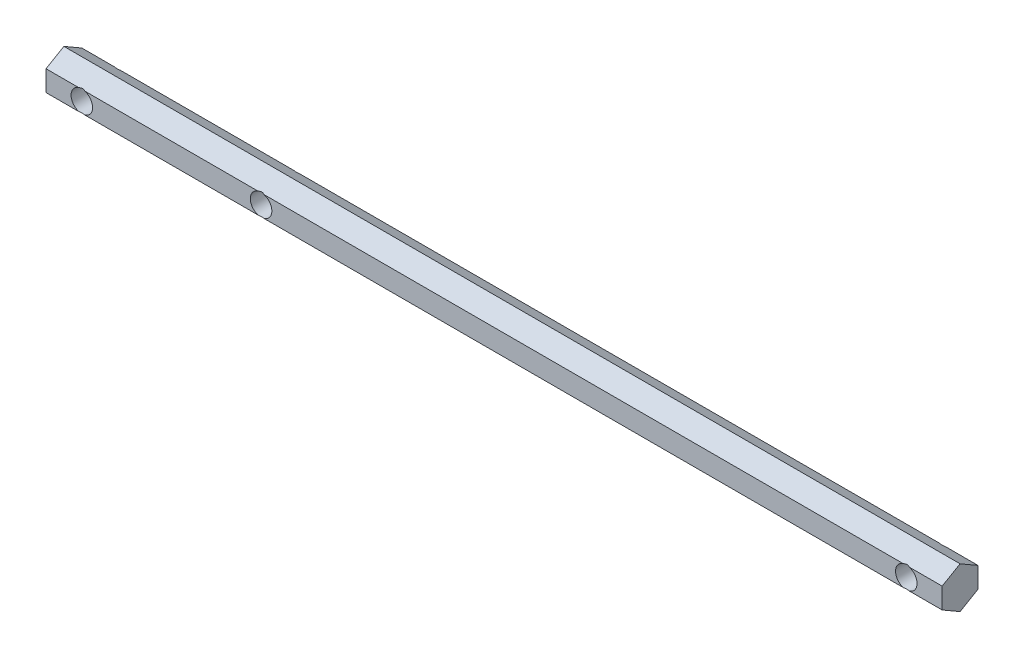
ISO-10303-21;
HEADER;
FILE_DESCRIPTION(('STEP AP214'),'2;1');
FILE_NAME('part.step','',(''),(''),'','','');
FILE_SCHEMA(('AUTOMOTIVE_DESIGN { 1 0 10303 214 1 1 1 1 }'));
ENDSEC;
DATA;
#1=APPLICATION_CONTEXT('core data for automotive mechanical design processes');
#2=APPLICATION_PROTOCOL_DEFINITION('international standard','automotive_design',2000,#1);
#3=PRODUCT_CONTEXT('',#1,'mechanical');
#4=PRODUCT('Part','Part','',(#3));
#5=PRODUCT_RELATED_PRODUCT_CATEGORY('part','',(#4));
#6=PRODUCT_DEFINITION_FORMATION('','',#4);
#7=PRODUCT_DEFINITION_CONTEXT('part definition',#1,'design');
#8=PRODUCT_DEFINITION('design','',#6,#7);
#9=PRODUCT_DEFINITION_SHAPE('','',#8);
#10=(LENGTH_UNIT() NAMED_UNIT(*) SI_UNIT(.MILLI.,.METRE.));
#11=(NAMED_UNIT(*) PLANE_ANGLE_UNIT() SI_UNIT($,.RADIAN.));
#12=(NAMED_UNIT(*) SI_UNIT($,.STERADIAN.) SOLID_ANGLE_UNIT());
#13=UNCERTAINTY_MEASURE_WITH_UNIT(LENGTH_MEASURE(1.E-05),#10,'distance_accuracy_value','');
#14=(GEOMETRIC_REPRESENTATION_CONTEXT(3) GLOBAL_UNCERTAINTY_ASSIGNED_CONTEXT((#13)) GLOBAL_UNIT_ASSIGNED_CONTEXT((#10,
#11,#12)) REPRESENTATION_CONTEXT('',''));
#15=CARTESIAN_POINT('',(0.,0.,0.));
#16=DIRECTION('',(0.,0.,1.));
#17=DIRECTION('',(1.,0.,0.));
#18=AXIS2_PLACEMENT_3D('',#15,#16,#17);
#19=CARTESIAN_POINT('',(125.,2.88675134594811,5.));
#20=DIRECTION('',(0.,0.,-1.));
#21=DIRECTION('',(0.,1.,0.));
#22=AXIS2_PLACEMENT_3D('',#19,#20,#21);
#23=PLANE('',#22);
#24=DIRECTION('',(-1.,0.,0.));
#25=VECTOR('',#24,1.);
#26=CARTESIAN_POINT('',(125.,2.88675134594811,5.));
#27=LINE('',#26,#25);
#28=CARTESIAN_POINT('',(125.,2.88675134594811,5.));
#29=VERTEX_POINT('',#28);
#30=CARTESIAN_POINT('',(115.816496580928,2.88675134594811,5.));
#31=VERTEX_POINT('',#30);
#32=EDGE_CURVE('E220',#29,#31,#27,.T.);
#33=ORIENTED_EDGE('',*,*,#32,.T.);
#34=CARTESIAN_POINT('',(115.,0.,5.));
#35=DIRECTION('',(0.,0.,1.));
#36=DIRECTION('',(1.,0.,0.));
#37=AXIS2_PLACEMENT_3D('',#34,#35,#36);
#38=CIRCLE('',#37,3.00000000000001);
#39=CARTESIAN_POINT('',(115.816496580928,-2.88675134594814,5.));
#40=VERTEX_POINT('',#39);
#41=EDGE_CURVE('E350',#40,#31,#38,.T.);
#42=ORIENTED_EDGE('',*,*,#41,.F.);
#43=DIRECTION('',(-1.,0.,0.));
#44=VECTOR('',#43,1.);
#45=CARTESIAN_POINT('',(125.,-2.88675134594815,4.99999999999998));
#46=LINE('',#45,#44);
#47=CARTESIAN_POINT('',(125.,-2.88675134594815,4.99999999999998));
#48=VERTEX_POINT('',#47);
#49=EDGE_CURVE('E214',#48,#40,#46,.T.);
#50=ORIENTED_EDGE('',*,*,#49,.F.);
#51=DIRECTION('',(0.,-1.,0.));
#52=VECTOR('',#51,1.);
#53=CARTESIAN_POINT('',(125.,2.88675134594811,5.));
#54=LINE('',#53,#52);
#55=EDGE_CURVE('E279',#29,#48,#54,.T.);
#56=ORIENTED_EDGE('',*,*,#55,.F.);
#57=EDGE_LOOP('',(#33,#42,#50,#56));
#58=FACE_BOUND('',#57,.T.);
#59=ADVANCED_FACE('F39',(#58),#23,.F.);
#60=CARTESIAN_POINT('',(-65.8164965809277,2.88675134594811,5.));
#61=VERTEX_POINT('',#60);
#62=CARTESIAN_POINT('',(-114.183503419072,2.88675134594811,5.));
#63=VERTEX_POINT('',#62);
#64=EDGE_CURVE('E317',#61,#63,#27,.T.);
#65=ORIENTED_EDGE('',*,*,#64,.T.);
#66=CARTESIAN_POINT('',(-115.,0.,5.));
#67=DIRECTION('',(0.,0.,1.));
#68=DIRECTION('',(1.,0.,0.));
#69=AXIS2_PLACEMENT_3D('',#66,#67,#68);
#70=CIRCLE('',#69,3.00000000000001);
#71=CARTESIAN_POINT('',(-114.183503419072,-2.88675134594814,5.));
#72=VERTEX_POINT('',#71);
#73=EDGE_CURVE('E371',#72,#63,#70,.T.);
#74=ORIENTED_EDGE('',*,*,#73,.F.);
#75=CARTESIAN_POINT('',(-65.8164965809278,-2.88675134594815,4.99999999999998));
#76=VERTEX_POINT('',#75);
#77=EDGE_CURVE('E360',#76,#72,#46,.T.);
#78=ORIENTED_EDGE('',*,*,#77,.F.);
#79=CARTESIAN_POINT('',(-65.,0.,5.));
#80=DIRECTION('',(0.,0.,1.));
#81=DIRECTION('',(1.,0.,0.));
#82=AXIS2_PLACEMENT_3D('',#79,#80,#81);
#83=CIRCLE('',#82,3.00000000000001);
#84=EDGE_CURVE('E63',#61,#76,#83,.T.);
#85=ORIENTED_EDGE('',*,*,#84,.F.);
#86=EDGE_LOOP('',(#65,#74,#78,#85));
#87=FACE_BOUND('',#86,.T.);
#88=ADVANCED_FACE('F369',(#87),#23,.F.);
#89=CARTESIAN_POINT('',(114.183503419072,-2.88675134594815,4.99999999999998));
#90=VERTEX_POINT('',#89);
#91=CARTESIAN_POINT('',(-64.1835034190722,-2.88675134594814,5.));
#92=VERTEX_POINT('',#91);
#93=EDGE_CURVE('E219',#90,#92,#46,.T.);
#94=ORIENTED_EDGE('',*,*,#93,.F.);
#95=CARTESIAN_POINT('',(114.183503419072,2.88675134594811,5.));
#96=VERTEX_POINT('',#95);
#97=EDGE_CURVE('E357',#96,#90,#38,.T.);
#98=ORIENTED_EDGE('',*,*,#97,.F.);
#99=CARTESIAN_POINT('',(-64.1835034190723,2.88675134594811,5.));
#100=VERTEX_POINT('',#99);
#101=EDGE_CURVE('E225',#96,#100,#27,.T.);
#102=ORIENTED_EDGE('',*,*,#101,.T.);
#103=EDGE_CURVE('E358',#92,#100,#83,.T.);
#104=ORIENTED_EDGE('',*,*,#103,.F.);
#105=EDGE_LOOP('',(#94,#98,#102,#104));
#106=FACE_BOUND('',#105,.T.);
#107=ADVANCED_FACE('F356',(#106),#23,.F.);
#108=CARTESIAN_POINT('',(125.,-2.88675134594808,-5.00000000000002));
#109=DIRECTION('',(0.,0.,1.));
#110=DIRECTION('',(0.,-1.,0.));
#111=AXIS2_PLACEMENT_3D('',#108,#109,#110);
#112=PLANE('',#111);
#113=DIRECTION('',(-1.,0.,0.));
#114=VECTOR('',#113,1.);
#115=CARTESIAN_POINT('',(125.,-2.88675134594808,-5.00000000000002));
#116=LINE('',#115,#114);
#117=CARTESIAN_POINT('',(125.,-2.88675134594808,-5.00000000000002));
#118=VERTEX_POINT('',#117);
#119=CARTESIAN_POINT('',(115.816496580928,-2.88675134594808,-5.00000000000002));
#120=VERTEX_POINT('',#119);
#121=EDGE_CURVE('E205',#118,#120,#116,.T.);
#122=ORIENTED_EDGE('',*,*,#121,.T.);
#123=CARTESIAN_POINT('',(115.,0.,-4.99999999999999));
#124=DIRECTION('',(0.,0.,1.));
#125=DIRECTION('',(0.,-1.,0.));
#126=AXIS2_PLACEMENT_3D('',#123,#124,#125);
#127=CIRCLE('',#126,3.00000000000001);
#128=CARTESIAN_POINT('',(115.816496580928,2.88675134594818,-5.00000000000002));
#129=VERTEX_POINT('',#128);
#130=EDGE_CURVE('E11',#120,#129,#127,.T.);
#131=ORIENTED_EDGE('',*,*,#130,.T.);
#132=DIRECTION('',(-1.,0.,0.));
#133=VECTOR('',#132,1.);
#134=CARTESIAN_POINT('',(125.,2.88675134594818,-4.99999999999996));
#135=LINE('',#134,#133);
#136=CARTESIAN_POINT('',(125.,2.88675134594818,-4.99999999999996));
#137=VERTEX_POINT('',#136);
#138=EDGE_CURVE('E194',#137,#129,#135,.T.);
#139=ORIENTED_EDGE('',*,*,#138,.F.);
#140=DIRECTION('',(0.,1.,0.));
#141=VECTOR('',#140,1.);
#142=CARTESIAN_POINT('',(125.,-2.88675134594808,-5.00000000000002));
#143=LINE('',#142,#141);
#144=EDGE_CURVE('E292',#118,#137,#143,.T.);
#145=ORIENTED_EDGE('',*,*,#144,.F.);
#146=EDGE_LOOP('',(#122,#131,#139,#145));
#147=FACE_BOUND('',#146,.T.);
#148=ADVANCED_FACE('F396',(#147),#112,.F.);
#149=CARTESIAN_POINT('',(-65.816496580928,-2.88675134594808,-5.00000000000002));
#150=VERTEX_POINT('',#149);
#151=CARTESIAN_POINT('',(-114.183503419072,-2.88675134594808,-5.00000000000002));
#152=VERTEX_POINT('',#151);
#153=EDGE_CURVE('E249',#150,#152,#116,.T.);
#154=ORIENTED_EDGE('',*,*,#153,.T.);
#155=CARTESIAN_POINT('',(-115.,0.,-4.99999999999999));
#156=DIRECTION('',(0.,0.,1.));
#157=DIRECTION('',(0.,-1.,0.));
#158=AXIS2_PLACEMENT_3D('',#155,#156,#157);
#159=CIRCLE('',#158,3.00000000000001);
#160=CARTESIAN_POINT('',(-114.183503419073,2.88675134594818,-5.00000000000002));
#161=VERTEX_POINT('',#160);
#162=EDGE_CURVE('E231',#152,#161,#159,.T.);
#163=ORIENTED_EDGE('',*,*,#162,.T.);
#164=CARTESIAN_POINT('',(-65.8164965809275,2.88675134594818,-5.00000000000002));
#165=VERTEX_POINT('',#164);
#166=EDGE_CURVE('E195',#165,#161,#135,.T.);
#167=ORIENTED_EDGE('',*,*,#166,.F.);
#168=CARTESIAN_POINT('',(-65.,0.,-4.99999999999999));
#169=DIRECTION('',(0.,0.,1.));
#170=DIRECTION('',(0.,-1.,0.));
#171=AXIS2_PLACEMENT_3D('',#168,#169,#170);
#172=CIRCLE('',#171,3.00000000000001);
#173=EDGE_CURVE('E170',#165,#150,#172,.T.);
#174=ORIENTED_EDGE('',*,*,#173,.T.);
#175=EDGE_LOOP('',(#154,#163,#167,#174));
#176=FACE_BOUND('',#175,.T.);
#177=ADVANCED_FACE('F399',(#176),#112,.F.);
#178=CARTESIAN_POINT('',(114.183503419072,2.88675134594818,-5.00000000000002));
#179=VERTEX_POINT('',#178);
#180=CARTESIAN_POINT('',(-64.1835034190725,2.88675134594818,-5.00000000000002));
#181=VERTEX_POINT('',#180);
#182=EDGE_CURVE('E184',#179,#181,#135,.T.);
#183=ORIENTED_EDGE('',*,*,#182,.F.);
#184=CARTESIAN_POINT('',(114.183503419072,-2.88675134594808,-5.00000000000002));
#185=VERTEX_POINT('',#184);
#186=EDGE_CURVE('E43',#179,#185,#127,.T.);
#187=ORIENTED_EDGE('',*,*,#186,.T.);
#188=CARTESIAN_POINT('',(-64.183503419072,-2.88675134594808,-5.00000000000002));
#189=VERTEX_POINT('',#188);
#190=EDGE_CURVE('E186',#185,#189,#116,.T.);
#191=ORIENTED_EDGE('',*,*,#190,.T.);
#192=EDGE_CURVE('E167',#189,#181,#172,.T.);
#193=ORIENTED_EDGE('',*,*,#192,.T.);
#194=EDGE_LOOP('',(#183,#187,#191,#193));
#195=FACE_BOUND('',#194,.T.);
#196=ADVANCED_FACE('F182',(#195),#112,.F.);
#197=CARTESIAN_POINT('',(125.,2.88675134594818,-4.99999999999996));
#198=DIRECTION('',(0.,-0.866025403784442,0.499999999999995));
#199=DIRECTION('',(0.,-0.499999999999995,-0.866025403784441));
#200=AXIS2_PLACEMENT_3D('',#197,#198,#199);
#201=PLANE('',#200);
#202=ORIENTED_EDGE('',*,*,#138,.T.);
#203=CARTESIAN_POINT('',(115.,0.,-10.0000000000001));
#204=DIRECTION('',(0.,-0.866025403784442,0.499999999999995));
#205=DIRECTION('',(0.,0.499999999999995,0.866025403784441));
#206=AXIS2_PLACEMENT_3D('',#203,#204,#205);
#207=ELLIPSE('',#206,6.00000000000008,3.00000000000001);
#208=EDGE_CURVE('E192',#129,#179,#207,.T.);
#209=ORIENTED_EDGE('',*,*,#208,.T.);
#210=ORIENTED_EDGE('',*,*,#182,.T.);
#211=CARTESIAN_POINT('',(-65.,0.,-10.0000000000002));
#212=DIRECTION('',(0.,-0.866025403784442,0.499999999999995));
#213=DIRECTION('',(0.,0.499999999999995,0.866025403784441));
#214=AXIS2_PLACEMENT_3D('',#211,#212,#213);
#215=ELLIPSE('',#214,6.00000000000008,3.00000000000001);
#216=EDGE_CURVE('E164',#181,#165,#215,.T.);
#217=ORIENTED_EDGE('',*,*,#216,.T.);
#218=ORIENTED_EDGE('',*,*,#166,.T.);
#219=CARTESIAN_POINT('',(-115.,0.,-10.0000000000002));
#220=DIRECTION('',(0.,-0.866025403784442,0.499999999999995));
#221=DIRECTION('',(0.,0.499999999999995,0.866025403784441));
#222=AXIS2_PLACEMENT_3D('',#219,#220,#221);
#223=ELLIPSE('',#222,6.00000000000008,3.00000000000001);
#224=CARTESIAN_POINT('',(-115.816496580927,2.88675134594818,-5.00000000000002));
#225=VERTEX_POINT('',#224);
#226=EDGE_CURVE('E322',#161,#225,#223,.T.);
#227=ORIENTED_EDGE('',*,*,#226,.T.);
#228=CARTESIAN_POINT('',(-125.,2.88675134594818,-4.99999999999996));
#229=VERTEX_POINT('',#228);
#230=EDGE_CURVE('E200',#225,#229,#135,.T.);
#231=ORIENTED_EDGE('',*,*,#230,.T.);
#232=DIRECTION('',(0.,0.499999999999995,0.866025403784441));
#233=VECTOR('',#232,1.);
#234=CARTESIAN_POINT('',(-125.,2.88675134594818,-4.99999999999996));
#235=LINE('',#234,#233);
#236=CARTESIAN_POINT('',(-125.,5.77350269189625,0.));
#237=VERTEX_POINT('',#236);
#238=EDGE_CURVE('E268',#229,#237,#235,.T.);
#239=ORIENTED_EDGE('',*,*,#238,.T.);
#240=DIRECTION('',(-1.,0.,0.));
#241=VECTOR('',#240,1.);
#242=CARTESIAN_POINT('',(125.,5.77350269189625,0.));
#243=LINE('',#242,#241);
#244=CARTESIAN_POINT('',(125.,5.77350269189625,0.));
#245=VERTEX_POINT('',#244);
#246=EDGE_CURVE('E224',#245,#237,#243,.T.);
#247=ORIENTED_EDGE('',*,*,#246,.F.);
#248=DIRECTION('',(0.,0.499999999999995,0.866025403784441));
#249=VECTOR('',#248,1.);
#250=CARTESIAN_POINT('',(125.,2.88675134594818,-4.99999999999996));
#251=LINE('',#250,#249);
#252=EDGE_CURVE('E270',#137,#245,#251,.T.);
#253=ORIENTED_EDGE('',*,*,#252,.F.);
#254=EDGE_LOOP('',(#202,#209,#210,#217,#218,#227,#231,#239,#247,#253));
#255=FACE_BOUND('',#254,.T.);
#256=ADVANCED_FACE('F41',(#255),#201,.F.);
#257=CARTESIAN_POINT('',(125.,5.77350269189625,0.));
#258=DIRECTION('',(0.,-0.866025403784438,-0.500000000000001));
#259=DIRECTION('',(0.,0.500000000000001,-0.866025403784438));
#260=AXIS2_PLACEMENT_3D('',#257,#258,#259);
#261=PLANE('',#260);
#262=ORIENTED_EDGE('',*,*,#101,.F.);
#263=CARTESIAN_POINT('',(115.,0.,9.99999999999996));
#264=DIRECTION('',(0.,-0.866025403784438,-0.500000000000001));
#265=DIRECTION('',(0.,-0.500000000000001,0.866025403784438));
#266=AXIS2_PLACEMENT_3D('',#263,#264,#265);
#267=ELLIPSE('',#266,6.,3.00000000000001);
#268=EDGE_CURVE('E338',#96,#31,#267,.T.);
#269=ORIENTED_EDGE('',*,*,#268,.T.);
#270=ORIENTED_EDGE('',*,*,#32,.F.);
#271=DIRECTION('',(0.,-0.500000000000001,0.866025403784438));
#272=VECTOR('',#271,1.);
#273=CARTESIAN_POINT('',(125.,5.77350269189625,0.));
#274=LINE('',#273,#272);
#275=EDGE_CURVE('E273',#245,#29,#274,.T.);
#276=ORIENTED_EDGE('',*,*,#275,.F.);
#277=ORIENTED_EDGE('',*,*,#246,.T.);
#278=DIRECTION('',(0.,-0.500000000000001,0.866025403784438));
#279=VECTOR('',#278,1.);
#280=CARTESIAN_POINT('',(-125.,5.77350269189625,0.));
#281=LINE('',#280,#279);
#282=CARTESIAN_POINT('',(-125.,2.88675134594811,5.));
#283=VERTEX_POINT('',#282);
#284=EDGE_CURVE('E297',#237,#283,#281,.T.);
#285=ORIENTED_EDGE('',*,*,#284,.T.);
#286=CARTESIAN_POINT('',(-115.816496580928,2.88675134594811,5.));
#287=VERTEX_POINT('',#286);
#288=EDGE_CURVE('E218',#287,#283,#27,.T.);
#289=ORIENTED_EDGE('',*,*,#288,.F.);
#290=CARTESIAN_POINT('',(-115.,0.,10.));
#291=DIRECTION('',(0.,-0.866025403784438,-0.500000000000001));
#292=DIRECTION('',(0.,-0.500000000000001,0.866025403784438));
#293=AXIS2_PLACEMENT_3D('',#290,#291,#292);
#294=ELLIPSE('',#293,6.,3.00000000000001);
#295=EDGE_CURVE('E326',#287,#63,#294,.T.);
#296=ORIENTED_EDGE('',*,*,#295,.T.);
#297=ORIENTED_EDGE('',*,*,#64,.F.);
#298=CARTESIAN_POINT('',(-65.,0.,10.));
#299=DIRECTION('',(0.,-0.866025403784438,-0.500000000000001));
#300=DIRECTION('',(0.,-0.500000000000001,0.866025403784438));
#301=AXIS2_PLACEMENT_3D('',#298,#299,#300);
#302=ELLIPSE('',#301,6.,3.00000000000001);
#303=EDGE_CURVE('E177',#61,#100,#302,.T.);
#304=ORIENTED_EDGE('',*,*,#303,.T.);
#305=EDGE_LOOP('',(#262,#269,#270,#276,#277,#285,#289,#296,#297,#304));
#306=FACE_BOUND('',#305,.T.);
#307=ADVANCED_FACE('F319',(#306),#261,.F.);
#308=CARTESIAN_POINT('',(-115.816496580928,-2.88675134594815,4.99999999999998));
#309=VERTEX_POINT('',#308);
#310=CARTESIAN_POINT('',(-125.,-2.88675134594815,4.99999999999998));
#311=VERTEX_POINT('',#310);
#312=EDGE_CURVE('E213',#309,#311,#46,.T.);
#313=ORIENTED_EDGE('',*,*,#312,.F.);
#314=EDGE_CURVE('E55',#287,#309,#70,.T.);
#315=ORIENTED_EDGE('',*,*,#314,.F.);
#316=ORIENTED_EDGE('',*,*,#288,.T.);
#317=DIRECTION('',(0.,-1.,0.));
#318=VECTOR('',#317,1.);
#319=CARTESIAN_POINT('',(-125.,2.88675134594811,5.));
#320=LINE('',#319,#318);
#321=EDGE_CURVE('E301',#283,#311,#320,.T.);
#322=ORIENTED_EDGE('',*,*,#321,.T.);
#323=EDGE_LOOP('',(#313,#315,#316,#322));
#324=FACE_BOUND('',#323,.T.);
#325=ADVANCED_FACE('F312',(#324),#23,.F.);
#326=CARTESIAN_POINT('',(125.,-2.88675134594815,4.99999999999998));
#327=DIRECTION('',(0.,0.866025403784441,-0.499999999999995));
#328=DIRECTION('',(0.,0.499999999999995,0.866025403784441));
#329=AXIS2_PLACEMENT_3D('',#326,#327,#328);
#330=PLANE('',#329);
#331=ORIENTED_EDGE('',*,*,#49,.T.);
#332=CARTESIAN_POINT('',(115.,0.,10.0000000000001));
#333=DIRECTION('',(0.,0.866025403784441,-0.499999999999995));
#334=DIRECTION('',(0.,0.499999999999995,0.866025403784441));
#335=AXIS2_PLACEMENT_3D('',#332,#333,#334);
#336=ELLIPSE('',#335,6.00000000000007,3.00000000000001);
#337=EDGE_CURVE('E330',#40,#90,#336,.T.);
#338=ORIENTED_EDGE('',*,*,#337,.T.);
#339=ORIENTED_EDGE('',*,*,#93,.T.);
#340=CARTESIAN_POINT('',(-65.,0.,10.));
#341=DIRECTION('',(0.,0.866025403784441,-0.499999999999995));
#342=DIRECTION('',(0.,0.499999999999995,0.866025403784441));
#343=AXIS2_PLACEMENT_3D('',#340,#341,#342);
#344=ELLIPSE('',#343,6.00000000000008,3.00000000000001);
#345=EDGE_CURVE('E365',#92,#76,#344,.T.);
#346=ORIENTED_EDGE('',*,*,#345,.T.);
#347=ORIENTED_EDGE('',*,*,#77,.T.);
#348=CARTESIAN_POINT('',(-115.,0.,10.));
#349=DIRECTION('',(0.,0.866025403784441,-0.499999999999995));
#350=DIRECTION('',(0.,0.499999999999995,0.866025403784441));
#351=AXIS2_PLACEMENT_3D('',#348,#349,#350);
#352=ELLIPSE('',#351,6.00000000000007,3.00000000000001);
#353=EDGE_CURVE('E332',#72,#309,#352,.T.);
#354=ORIENTED_EDGE('',*,*,#353,.T.);
#355=ORIENTED_EDGE('',*,*,#312,.T.);
#356=DIRECTION('',(0.,-0.499999999999995,-0.866025403784441));
#357=VECTOR('',#356,1.);
#358=CARTESIAN_POINT('',(-125.,-2.88675134594815,4.99999999999998));
#359=LINE('',#358,#357);
#360=CARTESIAN_POINT('',(-125.,-5.77350269189625,0.));
#361=VERTEX_POINT('',#360);
#362=EDGE_CURVE('E265',#311,#361,#359,.T.);
#363=ORIENTED_EDGE('',*,*,#362,.T.);
#364=DIRECTION('',(-1.,0.,0.));
#365=VECTOR('',#364,1.);
#366=CARTESIAN_POINT('',(125.,-5.77350269189625,0.));
#367=LINE('',#366,#365);
#368=CARTESIAN_POINT('',(125.,-5.77350269189625,0.));
#369=VERTEX_POINT('',#368);
#370=EDGE_CURVE('E209',#369,#361,#367,.T.);
#371=ORIENTED_EDGE('',*,*,#370,.F.);
#372=DIRECTION('',(0.,-0.499999999999995,-0.866025403784441));
#373=VECTOR('',#372,1.);
#374=CARTESIAN_POINT('',(125.,-2.88675134594815,4.99999999999998));
#375=LINE('',#374,#373);
#376=EDGE_CURVE('E286',#48,#369,#375,.T.);
#377=ORIENTED_EDGE('',*,*,#376,.F.);
#378=EDGE_LOOP('',(#331,#338,#339,#346,#347,#354,#355,#363,#371,#377));
#379=FACE_BOUND('',#378,.T.);
#380=ADVANCED_FACE('F307',(#379),#330,.F.);
#381=CARTESIAN_POINT('',(125.,-5.77350269189625,0.));
#382=DIRECTION('',(0.,0.866025403784435,0.500000000000007));
#383=DIRECTION('',(0.,-0.500000000000007,0.866025403784435));
#384=AXIS2_PLACEMENT_3D('',#381,#382,#383);
#385=PLANE('',#384);
#386=ORIENTED_EDGE('',*,*,#190,.F.);
#387=CARTESIAN_POINT('',(115.,0.,-9.99999999999984));
#388=DIRECTION('',(0.,0.866025403784435,0.500000000000007));
#389=DIRECTION('',(0.,-0.500000000000007,0.866025403784435));
#390=AXIS2_PLACEMENT_3D('',#387,#388,#389);
#391=ELLIPSE('',#390,5.99999999999993,3.00000000000001);
#392=EDGE_CURVE('E245',#185,#120,#391,.T.);
#393=ORIENTED_EDGE('',*,*,#392,.T.);
#394=ORIENTED_EDGE('',*,*,#121,.F.);
#395=DIRECTION('',(0.,0.500000000000007,-0.866025403784435));
#396=VECTOR('',#395,1.);
#397=CARTESIAN_POINT('',(125.,-5.77350269189625,0.));
#398=LINE('',#397,#396);
#399=EDGE_CURVE('E289',#369,#118,#398,.T.);
#400=ORIENTED_EDGE('',*,*,#399,.F.);
#401=ORIENTED_EDGE('',*,*,#370,.T.);
#402=DIRECTION('',(0.,0.500000000000007,-0.866025403784435));
#403=VECTOR('',#402,1.);
#404=CARTESIAN_POINT('',(-125.,-5.77350269189625,0.));
#405=LINE('',#404,#403);
#406=CARTESIAN_POINT('',(-125.,-2.88675134594808,-5.00000000000002));
#407=VERTEX_POINT('',#406);
#408=EDGE_CURVE('E259',#361,#407,#405,.T.);
#409=ORIENTED_EDGE('',*,*,#408,.T.);
#410=CARTESIAN_POINT('',(-115.816496580928,-2.88675134594808,-5.00000000000002));
#411=VERTEX_POINT('',#410);
#412=EDGE_CURVE('E199',#411,#407,#116,.T.);
#413=ORIENTED_EDGE('',*,*,#412,.F.);
#414=CARTESIAN_POINT('',(-115.,0.,-9.99999999999979));
#415=DIRECTION('',(0.,0.866025403784435,0.500000000000007));
#416=DIRECTION('',(0.,-0.500000000000007,0.866025403784435));
#417=AXIS2_PLACEMENT_3D('',#414,#415,#416);
#418=ELLIPSE('',#417,5.99999999999993,3.00000000000001);
#419=EDGE_CURVE('E176',#411,#152,#418,.T.);
#420=ORIENTED_EDGE('',*,*,#419,.T.);
#421=ORIENTED_EDGE('',*,*,#153,.F.);
#422=CARTESIAN_POINT('',(-65.,0.,-9.9999999999998));
#423=DIRECTION('',(0.,0.866025403784435,0.500000000000007));
#424=DIRECTION('',(0.,-0.500000000000007,0.866025403784435));
#425=AXIS2_PLACEMENT_3D('',#422,#423,#424);
#426=ELLIPSE('',#425,5.99999999999993,3.00000000000001);
#427=EDGE_CURVE('E247',#150,#189,#426,.T.);
#428=ORIENTED_EDGE('',*,*,#427,.T.);
#429=EDGE_LOOP('',(#386,#393,#394,#400,#401,#409,#413,#420,#421,#428));
#430=FACE_BOUND('',#429,.T.);
#431=ADVANCED_FACE('F243',(#430),#385,.F.);
#432=ORIENTED_EDGE('',*,*,#230,.F.);
#433=EDGE_CURVE('E188',#225,#411,#159,.T.);
#434=ORIENTED_EDGE('',*,*,#433,.T.);
#435=ORIENTED_EDGE('',*,*,#412,.T.);
#436=DIRECTION('',(0.,1.,0.));
#437=VECTOR('',#436,1.);
#438=CARTESIAN_POINT('',(-125.,-2.88675134594808,-5.00000000000002));
#439=LINE('',#438,#437);
#440=EDGE_CURVE('E203',#407,#229,#439,.T.);
#441=ORIENTED_EDGE('',*,*,#440,.T.);
#442=EDGE_LOOP('',(#432,#434,#435,#441));
#443=FACE_BOUND('',#442,.T.);
#444=ADVANCED_FACE('F254',(#443),#112,.F.);
#445=CARTESIAN_POINT('',(125.,0.,0.));
#446=DIRECTION('',(1.,0.,0.));
#447=DIRECTION('',(0.,0.,-1.));
#448=AXIS2_PLACEMENT_3D('',#445,#446,#447);
#449=PLANE('',#448);
#450=ORIENTED_EDGE('',*,*,#252,.T.);
#451=ORIENTED_EDGE('',*,*,#275,.T.);
#452=ORIENTED_EDGE('',*,*,#55,.T.);
#453=ORIENTED_EDGE('',*,*,#376,.T.);
#454=ORIENTED_EDGE('',*,*,#399,.T.);
#455=ORIENTED_EDGE('',*,*,#144,.T.);
#456=EDGE_LOOP('',(#450,#451,#452,#453,#454,#455));
#457=FACE_BOUND('',#456,.T.);
#458=ADVANCED_FACE('F351',(#457),#449,.T.);
#459=CARTESIAN_POINT('',(-125.,0.,0.));
#460=DIRECTION('',(1.,0.,0.));
#461=DIRECTION('',(0.,0.,-1.));
#462=AXIS2_PLACEMENT_3D('',#459,#460,#461);
#463=PLANE('',#462);
#464=ORIENTED_EDGE('',*,*,#238,.F.);
#465=ORIENTED_EDGE('',*,*,#440,.F.);
#466=ORIENTED_EDGE('',*,*,#408,.F.);
#467=ORIENTED_EDGE('',*,*,#362,.F.);
#468=ORIENTED_EDGE('',*,*,#321,.F.);
#469=ORIENTED_EDGE('',*,*,#284,.F.);
#470=EDGE_LOOP('',(#464,#465,#466,#467,#468,#469));
#471=FACE_BOUND('',#470,.T.);
#472=ADVANCED_FACE('F266',(#471),#463,.F.);
#473=CARTESIAN_POINT('',(-65.,0.,-5.00000000000002));
#474=DIRECTION('',(0.,0.,1.));
#475=DIRECTION('',(1.,0.,0.));
#476=AXIS2_PLACEMENT_3D('',#473,#474,#475);
#477=CYLINDRICAL_SURFACE('',#476,3.00000000000001);
#478=ORIENTED_EDGE('',*,*,#84,.T.);
#479=ORIENTED_EDGE('',*,*,#345,.F.);
#480=ORIENTED_EDGE('',*,*,#103,.T.);
#481=ORIENTED_EDGE('',*,*,#303,.F.);
#482=EDGE_LOOP('',(#478,#479,#480,#481));
#483=FACE_BOUND('',#482,.T.);
#484=ORIENTED_EDGE('',*,*,#192,.F.);
#485=ORIENTED_EDGE('',*,*,#427,.F.);
#486=ORIENTED_EDGE('',*,*,#173,.F.);
#487=ORIENTED_EDGE('',*,*,#216,.F.);
#488=EDGE_LOOP('',(#484,#485,#486,#487));
#489=FACE_BOUND('',#488,.T.);
#490=ADVANCED_FACE('F166',(#483,#489),#477,.F.);
#491=CARTESIAN_POINT('',(-115.,0.,-5.00000000000002));
#492=DIRECTION('',(0.,0.,1.));
#493=DIRECTION('',(1.,0.,0.));
#494=AXIS2_PLACEMENT_3D('',#491,#492,#493);
#495=CYLINDRICAL_SURFACE('',#494,3.00000000000001);
#496=ORIENTED_EDGE('',*,*,#314,.T.);
#497=ORIENTED_EDGE('',*,*,#353,.F.);
#498=ORIENTED_EDGE('',*,*,#73,.T.);
#499=ORIENTED_EDGE('',*,*,#295,.F.);
#500=EDGE_LOOP('',(#496,#497,#498,#499));
#501=FACE_BOUND('',#500,.T.);
#502=ORIENTED_EDGE('',*,*,#162,.F.);
#503=ORIENTED_EDGE('',*,*,#419,.F.);
#504=ORIENTED_EDGE('',*,*,#433,.F.);
#505=ORIENTED_EDGE('',*,*,#226,.F.);
#506=EDGE_LOOP('',(#502,#503,#504,#505));
#507=FACE_BOUND('',#506,.T.);
#508=ADVANCED_FACE('F392',(#501,#507),#495,.F.);
#509=CARTESIAN_POINT('',(115.,0.,-5.00000000000002));
#510=DIRECTION('',(0.,0.,1.));
#511=DIRECTION('',(1.,0.,0.));
#512=AXIS2_PLACEMENT_3D('',#509,#510,#511);
#513=CYLINDRICAL_SURFACE('',#512,3.00000000000001);
#514=ORIENTED_EDGE('',*,*,#97,.T.);
#515=ORIENTED_EDGE('',*,*,#337,.F.);
#516=ORIENTED_EDGE('',*,*,#41,.T.);
#517=ORIENTED_EDGE('',*,*,#268,.F.);
#518=EDGE_LOOP('',(#514,#515,#516,#517));
#519=FACE_BOUND('',#518,.T.);
#520=ORIENTED_EDGE('',*,*,#130,.F.);
#521=ORIENTED_EDGE('',*,*,#392,.F.);
#522=ORIENTED_EDGE('',*,*,#186,.F.);
#523=ORIENTED_EDGE('',*,*,#208,.F.);
#524=EDGE_LOOP('',(#520,#521,#522,#523));
#525=FACE_BOUND('',#524,.T.);
#526=ADVANCED_FACE('F390',(#519,#525),#513,.F.);
#527=CLOSED_SHELL('',(#59,#88,#107,#148,#177,#196,#256,#307,#325,#380,#431,#444,#458,#472,#490,
#508,#526));
#528=MANIFOLD_SOLID_BREP('B2',#527);
#529=ADVANCED_BREP_SHAPE_REPRESENTATION('',(#18,#528),#14);
#530=SHAPE_DEFINITION_REPRESENTATION(#9,#529);
ENDSEC;
END-ISO-10303-21;
